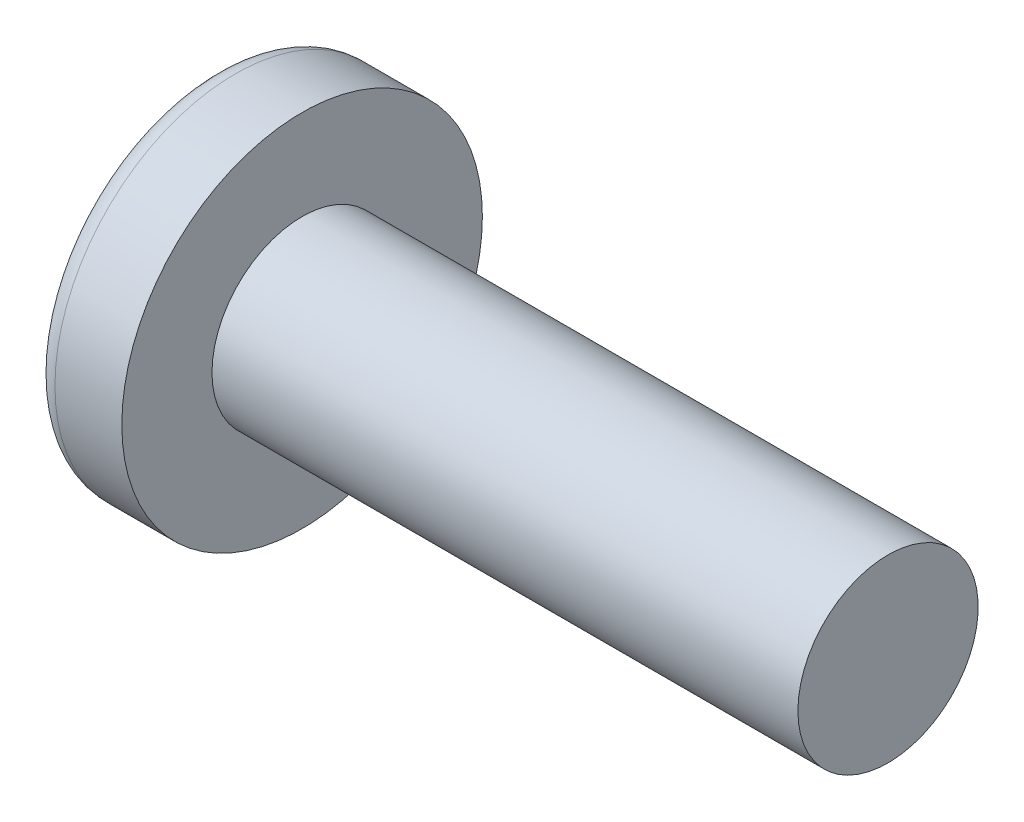
ISO-10303-21;
HEADER;
FILE_DESCRIPTION(('STEP AP214'),'2;1');
FILE_NAME('part.step','',(''),(''),'','','');
FILE_SCHEMA(('AUTOMOTIVE_DESIGN { 1 0 10303 214 1 1 1 1 }'));
ENDSEC;
DATA;
#1=APPLICATION_CONTEXT('core data for automotive mechanical design processes');
#2=APPLICATION_PROTOCOL_DEFINITION('international standard','automotive_design',2000,#1);
#3=PRODUCT_CONTEXT('',#1,'mechanical');
#4=PRODUCT('Part','Part','',(#3));
#5=PRODUCT_RELATED_PRODUCT_CATEGORY('part','',(#4));
#6=PRODUCT_DEFINITION_FORMATION('','',#4);
#7=PRODUCT_DEFINITION_CONTEXT('part definition',#1,'design');
#8=PRODUCT_DEFINITION('design','',#6,#7);
#9=PRODUCT_DEFINITION_SHAPE('','',#8);
#10=(LENGTH_UNIT() NAMED_UNIT(*) SI_UNIT(.MILLI.,.METRE.));
#11=(NAMED_UNIT(*) PLANE_ANGLE_UNIT() SI_UNIT($,.RADIAN.));
#12=(NAMED_UNIT(*) SI_UNIT($,.STERADIAN.) SOLID_ANGLE_UNIT());
#13=UNCERTAINTY_MEASURE_WITH_UNIT(LENGTH_MEASURE(1.E-05),#10,'distance_accuracy_value','');
#14=(GEOMETRIC_REPRESENTATION_CONTEXT(3) GLOBAL_UNCERTAINTY_ASSIGNED_CONTEXT((#13)) GLOBAL_UNIT_ASSIGNED_CONTEXT((#10,
#11,#12)) REPRESENTATION_CONTEXT('',''));
#15=CARTESIAN_POINT('',(0.,0.,0.));
#16=DIRECTION('',(0.,0.,1.));
#17=DIRECTION('',(1.,0.,0.));
#18=AXIS2_PLACEMENT_3D('',#15,#16,#17);
#19=CARTESIAN_POINT('',(6.5,0.,0.));
#20=DIRECTION('',(-1.,0.,0.));
#21=DIRECTION('',(0.,1.,0.));
#22=AXIS2_PLACEMENT_3D('',#19,#20,#21);
#23=SPHERICAL_SURFACE('',#22,6.5);
#24=CARTESIAN_POINT('',(1.22696010591455,0.,0.));
#25=DIRECTION('',(-1.,0.,0.));
#26=DIRECTION('',(0.,0.,1.));
#27=AXIS2_PLACEMENT_3D('',#24,#25,#26);
#28=CIRCLE('',#27,3.80066445182724);
#29=CARTESIAN_POINT('',(1.22696010591455,0.,3.80066445182724));
#30=VERTEX_POINT('',#29);
#31=EDGE_CURVE('E172',#30,#30,#28,.T.);
#32=ORIENTED_EDGE('',*,*,#31,.T.);
#33=EDGE_LOOP('',(#32));
#34=FACE_BOUND('',#33,.T.);
#35=CARTESIAN_POINT('',(6.48571960757402,-0.15048155459631,0.));
#36=DIRECTION('',(-0.0944735162161081,-0.995527375180494,0.));
#37=DIRECTION('',(0.995527375180495,-0.0944735162161082,0.));
#38=AXIS2_PLACEMENT_3D('',#35,#36,#37);
#39=CIRCLE('',#38,6.49824217555166);
#40=CARTESIAN_POINT('',(0.314004666074214,0.435201598015399,1.94783502836694));
#41=VERTEX_POINT('',#40);
#42=CARTESIAN_POINT('',(0.0329034112486453,0.461877533422321,0.461877533422322));
#43=VERTEX_POINT('',#42);
#44=EDGE_CURVE('E214',#41,#43,#39,.T.);
#45=ORIENTED_EDGE('',*,*,#44,.F.);
#46=CARTESIAN_POINT('',(5.02565375064329,0.,-1.83590765485334));
#47=DIRECTION('',(0.626149356629992,0.,0.779703137861998));
#48=DIRECTION('',(0.779703137861998,0.,-0.626149356629992));
#49=AXIS2_PLACEMENT_3D('',#46,#47,#48);
#50=CIRCLE('',#49,6.05852673674539);
#51=CARTESIAN_POINT('',(0.314004666074213,-0.435201598015413,1.94783502836693));
#52=VERTEX_POINT('',#51);
#53=EDGE_CURVE('E167',#41,#52,#50,.T.);
#54=ORIENTED_EDGE('',*,*,#53,.T.);
#55=CARTESIAN_POINT('',(6.48571960757402,0.150481554596309,0.));
#56=DIRECTION('',(-0.0944735162161078,0.995527375180494,0.));
#57=DIRECTION('',(-0.995527375180495,-0.0944735162161079,0.));
#58=AXIS2_PLACEMENT_3D('',#55,#56,#57);
#59=CIRCLE('',#58,6.49824217555166);
#60=CARTESIAN_POINT('',(0.0329034112486444,-0.461877533422323,0.461877533422322));
#61=VERTEX_POINT('',#60);
#62=EDGE_CURVE('E116',#61,#52,#59,.T.);
#63=ORIENTED_EDGE('',*,*,#62,.F.);
#64=CARTESIAN_POINT('',(6.48571960757402,0.,-0.150481554596309));
#65=DIRECTION('',(-0.0944735162161078,0.,-0.995527375180494));
#66=DIRECTION('',(-0.995527375180495,0.,0.0944735162161079));
#67=AXIS2_PLACEMENT_3D('',#64,#65,#66);
#68=CIRCLE('',#67,6.49824217555166);
#69=CARTESIAN_POINT('',(0.314004666074211,-1.94783502836694,0.435201598015406));
#70=VERTEX_POINT('',#69);
#71=EDGE_CURVE('E143',#70,#61,#68,.T.);
#72=ORIENTED_EDGE('',*,*,#71,.F.);
#73=CARTESIAN_POINT('',(5.02565375064329,1.83590765485333,0.));
#74=DIRECTION('',(0.626149356629993,-0.779703137861998,0.));
#75=DIRECTION('',(0.779703137861998,0.626149356629993,0.));
#76=AXIS2_PLACEMENT_3D('',#73,#74,#75);
#77=CIRCLE('',#76,6.05852673674539);
#78=CARTESIAN_POINT('',(0.314004666074211,-1.94783502836694,-0.435201598015407));
#79=VERTEX_POINT('',#78);
#80=EDGE_CURVE('E152',#70,#79,#77,.T.);
#81=ORIENTED_EDGE('',*,*,#80,.T.);
#82=CARTESIAN_POINT('',(6.48571960757402,0.,0.15048155459631));
#83=DIRECTION('',(-0.0944735162161081,0.,0.995527375180494));
#84=DIRECTION('',(0.995527375180495,0.,0.0944735162161082));
#85=AXIS2_PLACEMENT_3D('',#82,#83,#84);
#86=CIRCLE('',#85,6.49824217555166);
#87=CARTESIAN_POINT('',(0.0329034112486453,-0.46187753342232,-0.461877533422323));
#88=VERTEX_POINT('',#87);
#89=EDGE_CURVE('E59',#88,#79,#86,.T.);
#90=ORIENTED_EDGE('',*,*,#89,.F.);
#91=CARTESIAN_POINT('',(0.314004666074213,-0.435201598015399,-1.94783502836694));
#92=VERTEX_POINT('',#91);
#93=EDGE_CURVE('E221',#92,#88,#59,.T.);
#94=ORIENTED_EDGE('',*,*,#93,.F.);
#95=CARTESIAN_POINT('',(5.02565375064329,0.,1.83590765485334));
#96=DIRECTION('',(0.626149356629993,0.,-0.779703137861998));
#97=DIRECTION('',(-0.779703137861998,0.,-0.626149356629993));
#98=AXIS2_PLACEMENT_3D('',#95,#96,#97);
#99=CIRCLE('',#98,6.05852673674539);
#100=CARTESIAN_POINT('',(0.314004666074214,0.435201598015413,-1.94783502836693));
#101=VERTEX_POINT('',#100);
#102=EDGE_CURVE('E145',#92,#101,#99,.T.);
#103=ORIENTED_EDGE('',*,*,#102,.T.);
#104=CARTESIAN_POINT('',(0.0329034112486453,0.461877533422324,-0.461877533422323));
#105=VERTEX_POINT('',#104);
#106=EDGE_CURVE('E210',#105,#101,#39,.T.);
#107=ORIENTED_EDGE('',*,*,#106,.F.);
#108=CARTESIAN_POINT('',(0.314004666074215,1.94783502836693,-0.435201598015406));
#109=VERTEX_POINT('',#108);
#110=EDGE_CURVE('E52',#109,#105,#86,.T.);
#111=ORIENTED_EDGE('',*,*,#110,.F.);
#112=CARTESIAN_POINT('',(5.02565375064329,-1.83590765485334,0.));
#113=DIRECTION('',(0.626149356629992,0.779703137861998,0.));
#114=DIRECTION('',(-0.779703137861998,0.626149356629992,0.));
#115=AXIS2_PLACEMENT_3D('',#112,#113,#114);
#116=CIRCLE('',#115,6.05852673674539);
#117=CARTESIAN_POINT('',(0.314004666074215,1.94783502836693,0.435201598015406));
#118=VERTEX_POINT('',#117);
#119=EDGE_CURVE('E11',#109,#118,#116,.T.);
#120=ORIENTED_EDGE('',*,*,#119,.T.);
#121=EDGE_CURVE('E191',#43,#118,#68,.T.);
#122=ORIENTED_EDGE('',*,*,#121,.F.);
#123=EDGE_LOOP('',(#45,#54,#63,#72,#81,#90,#94,#103,#107,#111,#120,#122));
#124=FACE_BOUND('',#123,.T.);
#125=ADVANCED_FACE('F43',(#34,#124),#23,.T.);
#126=CARTESIAN_POINT('',(2.73951715374841,0.,-0.20502541296061));
#127=DIRECTION('',(-0.0944735162161081,0.,0.995527375180494));
#128=DIRECTION('',(0.995527375180495,0.,0.0944735162161082));
#129=AXIS2_PLACEMENT_3D('',#126,#127,#128);
#130=PLANE('',#129);
#131=ORIENTED_EDGE('',*,*,#110,.T.);
#132=DIRECTION('',(0.991114231601325,-0.0940547178968607,0.0940547178968604));
#133=VECTOR('',#132,1.);
#134=CARTESIAN_POINT('',(2.75862941145706,0.203211698708667,-0.203211698708667));
#135=LINE('',#134,#133);
#136=CARTESIAN_POINT('',(2.45,0.232500000000001,-0.232499999999999));
#137=VERTEX_POINT('',#136);
#138=EDGE_CURVE('E211',#105,#137,#135,.T.);
#139=ORIENTED_EDGE('',*,*,#138,.T.);
#140=DIRECTION('',(0.777577482844895,-0.624442325509115,0.0737905162291584));
#141=VECTOR('',#140,1.);
#142=CARTESIAN_POINT('',(0.,2.2,-0.465));
#143=LINE('',#142,#141);
#144=EDGE_CURVE('E173',#109,#137,#143,.T.);
#145=ORIENTED_EDGE('',*,*,#144,.F.);
#146=EDGE_LOOP('',(#131,#139,#145));
#147=FACE_BOUND('',#146,.T.);
#148=ADVANCED_FACE('F254',(#147),#130,.T.);
#149=DIRECTION('',(0.777577482844895,0.624442325509115,0.0737905162291584));
#150=VECTOR('',#149,1.);
#151=CARTESIAN_POINT('',(0.,-2.2,-0.465));
#152=LINE('',#151,#150);
#153=CARTESIAN_POINT('',(2.45,-0.2325,-0.2325));
#154=VERTEX_POINT('',#153);
#155=EDGE_CURVE('E154',#79,#154,#152,.T.);
#156=ORIENTED_EDGE('',*,*,#155,.T.);
#157=DIRECTION('',(-0.991114231601325,-0.0940547178968598,-0.0940547178968604));
#158=VECTOR('',#157,1.);
#159=CARTESIAN_POINT('',(2.75862941145706,-0.203211698708666,-0.203211698708667));
#160=LINE('',#159,#158);
#161=EDGE_CURVE('E222',#154,#88,#160,.T.);
#162=ORIENTED_EDGE('',*,*,#161,.T.);
#163=ORIENTED_EDGE('',*,*,#89,.T.);
#164=EDGE_LOOP('',(#156,#162,#163));
#165=FACE_BOUND('',#164,.T.);
#166=ADVANCED_FACE('F251',(#165),#130,.T.);
#167=CARTESIAN_POINT('',(2.73951715374841,0.,0.20502541296061));
#168=DIRECTION('',(-0.0944735162161078,0.,-0.995527375180494));
#169=DIRECTION('',(-0.995527375180495,0.,0.0944735162161079));
#170=AXIS2_PLACEMENT_3D('',#167,#168,#169);
#171=PLANE('',#170);
#172=DIRECTION('',(0.777577482844895,-0.624442325509115,-0.0737905162291583));
#173=VECTOR('',#172,1.);
#174=CARTESIAN_POINT('',(0.,2.2,0.465));
#175=LINE('',#174,#173);
#176=CARTESIAN_POINT('',(2.45,0.2325,0.2325));
#177=VERTEX_POINT('',#176);
#178=EDGE_CURVE('E202',#118,#177,#175,.T.);
#179=ORIENTED_EDGE('',*,*,#178,.T.);
#180=DIRECTION('',(-0.991114231601325,0.0940547178968601,0.0940547178968601));
#181=VECTOR('',#180,1.);
#182=CARTESIAN_POINT('',(2.75862941145706,0.203211698708666,0.203211698708667));
#183=LINE('',#182,#181);
#184=EDGE_CURVE('E217',#177,#43,#183,.T.);
#185=ORIENTED_EDGE('',*,*,#184,.T.);
#186=ORIENTED_EDGE('',*,*,#121,.T.);
#187=EDGE_LOOP('',(#179,#185,#186));
#188=FACE_BOUND('',#187,.T.);
#189=ADVANCED_FACE('F253',(#188),#171,.T.);
#190=ORIENTED_EDGE('',*,*,#71,.T.);
#191=DIRECTION('',(0.991114231601325,0.0940547178968604,-0.0940547178968601));
#192=VECTOR('',#191,1.);
#193=CARTESIAN_POINT('',(2.75862941145706,-0.203211698708668,0.203211698708667));
#194=LINE('',#193,#192);
#195=CARTESIAN_POINT('',(2.45,-0.232500000000001,0.232499999999999));
#196=VERTEX_POINT('',#195);
#197=EDGE_CURVE('E114',#61,#196,#194,.T.);
#198=ORIENTED_EDGE('',*,*,#197,.T.);
#199=DIRECTION('',(0.777577482844895,0.624442325509115,-0.0737905162291581));
#200=VECTOR('',#199,1.);
#201=CARTESIAN_POINT('',(0.,-2.2,0.464999999999999));
#202=LINE('',#201,#200);
#203=EDGE_CURVE('E141',#70,#196,#202,.T.);
#204=ORIENTED_EDGE('',*,*,#203,.F.);
#205=EDGE_LOOP('',(#190,#198,#204));
#206=FACE_BOUND('',#205,.T.);
#207=ADVANCED_FACE('F140',(#206),#171,.T.);
#208=CARTESIAN_POINT('',(-25.4,0.,0.));
#209=DIRECTION('',(-1.,0.,0.));
#210=DIRECTION('',(0.,0.,1.));
#211=AXIS2_PLACEMENT_3D('',#208,#209,#210);
#212=CYLINDRICAL_SURFACE('',#211,2.);
#213=CARTESIAN_POINT('',(16.1,0.,0.));
#214=DIRECTION('',(-1.,0.,0.));
#215=DIRECTION('',(0.,0.,1.));
#216=AXIS2_PLACEMENT_3D('',#213,#214,#215);
#217=CIRCLE('',#216,2.);
#218=CARTESIAN_POINT('',(16.1,0.,2.));
#219=VERTEX_POINT('',#218);
#220=EDGE_CURVE('E168',#219,#219,#217,.T.);
#221=ORIENTED_EDGE('',*,*,#220,.T.);
#222=EDGE_LOOP('',(#221));
#223=FACE_BOUND('',#222,.T.);
#224=CARTESIAN_POINT('',(3.1,0.,0.));
#225=DIRECTION('',(-1.,0.,0.));
#226=DIRECTION('',(0.,0.,1.));
#227=AXIS2_PLACEMENT_3D('',#224,#225,#226);
#228=CIRCLE('',#227,2.);
#229=CARTESIAN_POINT('',(3.1,0.,2.));
#230=VERTEX_POINT('',#229);
#231=EDGE_CURVE('E185',#230,#230,#228,.T.);
#232=ORIENTED_EDGE('',*,*,#231,.F.);
#233=EDGE_LOOP('',(#232));
#234=FACE_BOUND('',#233,.T.);
#235=ADVANCED_FACE('F45',(#223,#234),#212,.T.);
#236=CARTESIAN_POINT('',(3.1,2.,0.));
#237=DIRECTION('',(-1.,0.,0.));
#238=DIRECTION('',(0.,0.,1.));
#239=AXIS2_PLACEMENT_3D('',#236,#237,#238);
#240=PLANE('',#239);
#241=CARTESIAN_POINT('',(3.1,0.,0.));
#242=DIRECTION('',(-1.,0.,0.));
#243=DIRECTION('',(0.,0.,1.));
#244=AXIS2_PLACEMENT_3D('',#241,#242,#243);
#245=CIRCLE('',#244,4.);
#246=CARTESIAN_POINT('',(3.1,0.,4.));
#247=VERTEX_POINT('',#246);
#248=EDGE_CURVE('E181',#247,#247,#245,.T.);
#249=ORIENTED_EDGE('',*,*,#248,.F.);
#250=EDGE_LOOP('',(#249));
#251=FACE_BOUND('',#250,.T.);
#252=ORIENTED_EDGE('',*,*,#231,.T.);
#253=EDGE_LOOP('',(#252));
#254=FACE_BOUND('',#253,.T.);
#255=ADVANCED_FACE('F278',(#251,#254),#240,.F.);
#256=CARTESIAN_POINT('',(-25.4,0.,0.));
#257=DIRECTION('',(-1.,0.,0.));
#258=DIRECTION('',(0.,0.,1.));
#259=AXIS2_PLACEMENT_3D('',#256,#257,#258);
#260=CYLINDRICAL_SURFACE('',#259,4.);
#261=ORIENTED_EDGE('',*,*,#248,.T.);
#262=EDGE_LOOP('',(#261));
#263=FACE_BOUND('',#262,.T.);
#264=CARTESIAN_POINT('',(1.61635382117009,0.,0.));
#265=DIRECTION('',(-1.,0.,0.));
#266=DIRECTION('',(0.,0.,1.));
#267=AXIS2_PLACEMENT_3D('',#264,#265,#266);
#268=CIRCLE('',#267,4.);
#269=CARTESIAN_POINT('',(1.61635382117009,0.,4.));
#270=VERTEX_POINT('',#269);
#271=EDGE_CURVE('E177',#270,#270,#268,.T.);
#272=ORIENTED_EDGE('',*,*,#271,.F.);
#273=EDGE_LOOP('',(#272));
#274=FACE_BOUND('',#273,.T.);
#275=ADVANCED_FACE('F275',(#263,#274),#260,.T.);
#276=CARTESIAN_POINT('',(1.61635382117009,0.,0.));
#277=DIRECTION('',(-1.,0.,0.));
#278=DIRECTION('',(0.,0.,1.));
#279=AXIS2_PLACEMENT_3D('',#276,#277,#278);
#280=TOROIDAL_SURFACE('',#279,3.52,0.479999999999999);
#281=ORIENTED_EDGE('',*,*,#271,.T.);
#282=EDGE_LOOP('',(#281));
#283=FACE_BOUND('',#282,.T.);
#284=ORIENTED_EDGE('',*,*,#31,.F.);
#285=EDGE_LOOP('',(#284));
#286=FACE_BOUND('',#285,.T.);
#287=ADVANCED_FACE('F272',(#283,#286),#280,.T.);
#288=CARTESIAN_POINT('',(16.1,2.,0.));
#289=DIRECTION('',(1.,0.,0.));
#290=DIRECTION('',(0.,0.,-1.));
#291=AXIS2_PLACEMENT_3D('',#288,#289,#290);
#292=PLANE('',#291);
#293=ORIENTED_EDGE('',*,*,#220,.F.);
#294=EDGE_LOOP('',(#293));
#295=FACE_BOUND('',#294,.T.);
#296=ADVANCED_FACE('F270',(#295),#292,.T.);
#297=CARTESIAN_POINT('',(2.45,0.2325,0.2325));
#298=DIRECTION('',(0.626149356629992,0.779703137861998,0.));
#299=DIRECTION('',(-0.779703137861998,0.626149356629992,0.));
#300=AXIS2_PLACEMENT_3D('',#297,#298,#299);
#301=PLANE('',#300);
#302=ORIENTED_EDGE('',*,*,#144,.T.);
#303=DIRECTION('',(0.,0.,-1.));
#304=VECTOR('',#303,1.);
#305=CARTESIAN_POINT('',(2.45,0.2325,0.2325));
#306=LINE('',#305,#304);
#307=EDGE_CURVE('E134',#177,#137,#306,.T.);
#308=ORIENTED_EDGE('',*,*,#307,.F.);
#309=ORIENTED_EDGE('',*,*,#178,.F.);
#310=ORIENTED_EDGE('',*,*,#119,.F.);
#311=EDGE_LOOP('',(#302,#308,#309,#310));
#312=FACE_BOUND('',#311,.T.);
#313=ADVANCED_FACE('F300',(#312),#301,.F.);
#314=CARTESIAN_POINT('',(2.45,-0.2325,-0.2325));
#315=DIRECTION('',(0.626149356629993,-0.779703137861998,0.));
#316=DIRECTION('',(0.779703137861998,0.626149356629993,0.));
#317=AXIS2_PLACEMENT_3D('',#314,#315,#316);
#318=PLANE('',#317);
#319=ORIENTED_EDGE('',*,*,#203,.T.);
#320=DIRECTION('',(0.,0.,1.));
#321=VECTOR('',#320,1.);
#322=CARTESIAN_POINT('',(2.45,-0.2325,-0.2325));
#323=LINE('',#322,#321);
#324=EDGE_CURVE('E133',#154,#196,#323,.T.);
#325=ORIENTED_EDGE('',*,*,#324,.F.);
#326=ORIENTED_EDGE('',*,*,#155,.F.);
#327=ORIENTED_EDGE('',*,*,#80,.F.);
#328=EDGE_LOOP('',(#319,#325,#326,#327));
#329=FACE_BOUND('',#328,.T.);
#330=ADVANCED_FACE('F149',(#329),#318,.F.);
#331=CARTESIAN_POINT('',(2.45,-0.2325,-0.2325));
#332=DIRECTION('',(1.,0.,0.));
#333=DIRECTION('',(0.,0.,-1.));
#334=AXIS2_PLACEMENT_3D('',#331,#332,#333);
#335=PLANE('',#334);
#336=DIRECTION('',(0.,1.,0.));
#337=VECTOR('',#336,1.);
#338=CARTESIAN_POINT('',(2.45,-0.2325,-0.2325));
#339=LINE('',#338,#337);
#340=EDGE_CURVE('E158',#154,#137,#339,.T.);
#341=ORIENTED_EDGE('',*,*,#340,.F.);
#342=ORIENTED_EDGE('',*,*,#324,.T.);
#343=DIRECTION('',(0.,-1.,0.));
#344=VECTOR('',#343,1.);
#345=CARTESIAN_POINT('',(2.45,0.2325,0.2325));
#346=LINE('',#345,#344);
#347=EDGE_CURVE('E124',#177,#196,#346,.T.);
#348=ORIENTED_EDGE('',*,*,#347,.F.);
#349=ORIENTED_EDGE('',*,*,#307,.T.);
#350=EDGE_LOOP('',(#341,#342,#348,#349));
#351=FACE_BOUND('',#350,.T.);
#352=ADVANCED_FACE('F156',(#351),#335,.F.);
#353=CARTESIAN_POINT('',(2.45,0.232500000000001,-0.232499999999999));
#354=DIRECTION('',(0.626149356629993,0.,-0.779703137861998));
#355=DIRECTION('',(0.779703137861998,0.,0.626149356629993));
#356=AXIS2_PLACEMENT_3D('',#353,#354,#355);
#357=PLANE('',#356);
#358=DIRECTION('',(0.777577482844895,0.0737905162291559,0.624442325509115));
#359=VECTOR('',#358,1.);
#360=CARTESIAN_POINT('',(0.,-0.464999999999991,-2.2));
#361=LINE('',#360,#359);
#362=EDGE_CURVE('E230',#92,#154,#361,.T.);
#363=ORIENTED_EDGE('',*,*,#362,.T.);
#364=ORIENTED_EDGE('',*,*,#340,.T.);
#365=DIRECTION('',(0.777577482844895,-0.0737905162291606,0.624442325509115));
#366=VECTOR('',#365,1.);
#367=CARTESIAN_POINT('',(0.,0.465000000000008,-2.2));
#368=LINE('',#367,#366);
#369=EDGE_CURVE('E121',#101,#137,#368,.T.);
#370=ORIENTED_EDGE('',*,*,#369,.F.);
#371=ORIENTED_EDGE('',*,*,#102,.F.);
#372=EDGE_LOOP('',(#363,#364,#370,#371));
#373=FACE_BOUND('',#372,.T.);
#374=ADVANCED_FACE('F244',(#373),#357,.F.);
#375=CARTESIAN_POINT('',(2.73951715374841,-0.20502541296061,0.));
#376=DIRECTION('',(-0.0944735162161078,0.995527375180494,0.));
#377=DIRECTION('',(-0.995527375180495,-0.0944735162161079,0.));
#378=AXIS2_PLACEMENT_3D('',#375,#376,#377);
#379=PLANE('',#378);
#380=ORIENTED_EDGE('',*,*,#93,.T.);
#381=ORIENTED_EDGE('',*,*,#161,.F.);
#382=ORIENTED_EDGE('',*,*,#362,.F.);
#383=EDGE_LOOP('',(#380,#381,#382));
#384=FACE_BOUND('',#383,.T.);
#385=ADVANCED_FACE('F250',(#384),#379,.T.);
#386=CARTESIAN_POINT('',(2.73951715374841,0.20502541296061,0.));
#387=DIRECTION('',(-0.0944735162161081,-0.995527375180494,0.));
#388=DIRECTION('',(0.995527375180495,-0.0944735162161082,0.));
#389=AXIS2_PLACEMENT_3D('',#386,#387,#388);
#390=PLANE('',#389);
#391=ORIENTED_EDGE('',*,*,#106,.T.);
#392=ORIENTED_EDGE('',*,*,#369,.T.);
#393=ORIENTED_EDGE('',*,*,#138,.F.);
#394=EDGE_LOOP('',(#391,#392,#393));
#395=FACE_BOUND('',#394,.T.);
#396=ADVANCED_FACE('F241',(#395),#390,.T.);
#397=CARTESIAN_POINT('',(2.45,-0.232500000000001,0.232499999999999));
#398=DIRECTION('',(0.626149356629992,0.,0.779703137861998));
#399=DIRECTION('',(-0.779703137861998,0.,0.626149356629992));
#400=AXIS2_PLACEMENT_3D('',#397,#398,#399);
#401=PLANE('',#400);
#402=DIRECTION('',(0.777577482844895,-0.0737905162291562,-0.624442325509115));
#403=VECTOR('',#402,1.);
#404=CARTESIAN_POINT('',(0.,0.464999999999992,2.2));
#405=LINE('',#404,#403);
#406=EDGE_CURVE('E120',#41,#177,#405,.T.);
#407=ORIENTED_EDGE('',*,*,#406,.T.);
#408=ORIENTED_EDGE('',*,*,#347,.T.);
#409=DIRECTION('',(0.777577482844895,0.0737905162291604,-0.624442325509114));
#410=VECTOR('',#409,1.);
#411=CARTESIAN_POINT('',(0.,-0.465000000000007,2.2));
#412=LINE('',#411,#410);
#413=EDGE_CURVE('E110',#52,#196,#412,.T.);
#414=ORIENTED_EDGE('',*,*,#413,.F.);
#415=ORIENTED_EDGE('',*,*,#53,.F.);
#416=EDGE_LOOP('',(#407,#408,#414,#415));
#417=FACE_BOUND('',#416,.T.);
#418=ADVANCED_FACE('F125',(#417),#401,.F.);
#419=ORIENTED_EDGE('',*,*,#44,.T.);
#420=ORIENTED_EDGE('',*,*,#184,.F.);
#421=ORIENTED_EDGE('',*,*,#406,.F.);
#422=EDGE_LOOP('',(#419,#420,#421));
#423=FACE_BOUND('',#422,.T.);
#424=ADVANCED_FACE('F315',(#423),#390,.T.);
#425=ORIENTED_EDGE('',*,*,#62,.T.);
#426=ORIENTED_EDGE('',*,*,#413,.T.);
#427=ORIENTED_EDGE('',*,*,#197,.F.);
#428=EDGE_LOOP('',(#425,#426,#427));
#429=FACE_BOUND('',#428,.T.);
#430=ADVANCED_FACE('F112',(#429),#379,.T.);
#431=CLOSED_SHELL('',(#125,#148,#166,#189,#207,#235,#255,#275,#287,#296,#313,#330,#352,#374,
#385,#396,#418,#424,#430));
#432=MANIFOLD_SOLID_BREP('B2',#431);
#433=ADVANCED_BREP_SHAPE_REPRESENTATION('',(#18,#432),#14);
#434=SHAPE_DEFINITION_REPRESENTATION(#9,#433);
ENDSEC;
END-ISO-10303-21;
